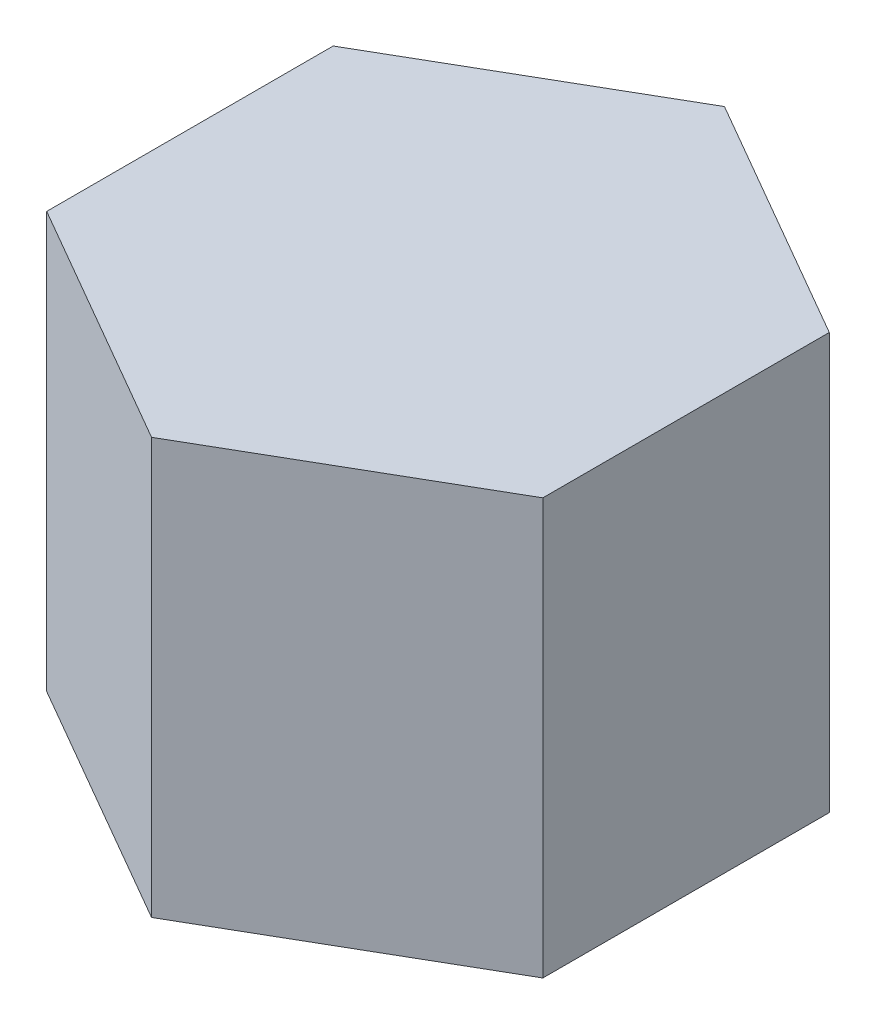
ISO-10303-21;
HEADER;
FILE_DESCRIPTION(('STEP AP214'),'2;1');
FILE_NAME('part.step','',(''),(''),'','','');
FILE_SCHEMA(('AUTOMOTIVE_DESIGN { 1 0 10303 214 1 1 1 1 }'));
ENDSEC;
DATA;
#1=APPLICATION_CONTEXT('core data for automotive mechanical design processes');
#2=APPLICATION_PROTOCOL_DEFINITION('international standard','automotive_design',2000,#1);
#3=PRODUCT_CONTEXT('',#1,'mechanical');
#4=PRODUCT('Part','Part','',(#3));
#5=PRODUCT_RELATED_PRODUCT_CATEGORY('part','',(#4));
#6=PRODUCT_DEFINITION_FORMATION('','',#4);
#7=PRODUCT_DEFINITION_CONTEXT('part definition',#1,'design');
#8=PRODUCT_DEFINITION('design','',#6,#7);
#9=PRODUCT_DEFINITION_SHAPE('','',#8);
#10=(LENGTH_UNIT() NAMED_UNIT(*) SI_UNIT(.MILLI.,.METRE.));
#11=(NAMED_UNIT(*) PLANE_ANGLE_UNIT() SI_UNIT($,.RADIAN.));
#12=(NAMED_UNIT(*) SI_UNIT($,.STERADIAN.) SOLID_ANGLE_UNIT());
#13=UNCERTAINTY_MEASURE_WITH_UNIT(LENGTH_MEASURE(1.E-05),#10,'distance_accuracy_value','');
#14=(GEOMETRIC_REPRESENTATION_CONTEXT(3) GLOBAL_UNCERTAINTY_ASSIGNED_CONTEXT((#13)) GLOBAL_UNIT_ASSIGNED_CONTEXT((#10,
#11,#12)) REPRESENTATION_CONTEXT('',''));
#15=CARTESIAN_POINT('',(0.,0.,0.));
#16=DIRECTION('',(0.,0.,1.));
#17=DIRECTION('',(1.,0.,0.));
#18=AXIS2_PLACEMENT_3D('',#15,#16,#17);
#19=CARTESIAN_POINT('',(204.142660308706,-148.537700895744,288.908895009141));
#20=DIRECTION('',(-0.499999999999943,0.,-0.866025403784472));
#21=DIRECTION('',(-0.866025403784472,0.,0.499999999999943));
#22=AXIS2_PLACEMENT_3D('',#19,#20,#21);
#23=PLANE('',#22);
#24=CARTESIAN_POINT('',(203.839551417382,-149.045793579175,289.083895009141));
#25=DIRECTION('',(0.866025403784471,0.,-0.499999999999943));
#26=VECTOR('',#25,1.);
#27=LINE('',#24,#26);
#28=CARTESIAN_POINT('',(203.839551417382,-149.045793579175,289.083895009141));
#29=VERTEX_POINT('',#28);
#30=CARTESIAN_POINT('',(204.142660308706,-149.045793579175,288.908895009141));
#31=VERTEX_POINT('',#30);
#32=EDGE_CURVE('E170',#29,#31,#27,.T.);
#33=ORIENTED_EDGE('',*,*,#32,.T.);
#34=CARTESIAN_POINT('',(204.142660308706,-148.537700895744,288.908895009141));
#35=DIRECTION('',(0.,-1.,0.));
#36=VECTOR('',#35,1.);
#37=LINE('',#34,#36);
#38=CARTESIAN_POINT('',(204.142660308706,-148.537700895744,288.908895009141));
#39=VERTEX_POINT('',#38);
#40=EDGE_CURVE('E35',#39,#31,#37,.T.);
#41=ORIENTED_EDGE('',*,*,#40,.F.);
#42=CARTESIAN_POINT('',(203.839551417382,-148.537700895744,289.083895009141));
#43=DIRECTION('',(0.866025403784471,0.,-0.499999999999943));
#44=VECTOR('',#43,1.);
#45=LINE('',#42,#44);
#46=CARTESIAN_POINT('',(203.839551417382,-148.537700895744,289.083895009141));
#47=VERTEX_POINT('',#46);
#48=EDGE_CURVE('E159',#47,#39,#45,.T.);
#49=ORIENTED_EDGE('',*,*,#48,.F.);
#50=CARTESIAN_POINT('',(203.839551417382,-148.537700895744,289.083895009141));
#51=DIRECTION('',(0.,-1.,0.));
#52=VECTOR('',#51,1.);
#53=LINE('',#50,#52);
#54=EDGE_CURVE('E10',#47,#29,#53,.T.);
#55=ORIENTED_EDGE('',*,*,#54,.T.);
#56=EDGE_LOOP('',(#33,#41,#49,#55));
#57=FACE_BOUND('',#56,.T.);
#58=ADVANCED_FACE('F16',(#57),#23,.F.);
#59=CARTESIAN_POINT('',(203.839551417382,-148.537700895744,289.083895009141));
#60=DIRECTION('',(0.500000000000062,0.,-0.866025403784403));
#61=DIRECTION('',(-0.866025403784403,0.,-0.500000000000062));
#62=AXIS2_PLACEMENT_3D('',#59,#60,#61);
#63=PLANE('',#62);
#64=CARTESIAN_POINT('',(203.536442526057,-149.045793579175,288.908895009141));
#65=DIRECTION('',(0.866025403784403,0.,0.500000000000062));
#66=VECTOR('',#65,1.);
#67=LINE('',#64,#66);
#68=CARTESIAN_POINT('',(203.536442526057,-149.045793579175,288.908895009141));
#69=VERTEX_POINT('',#68);
#70=EDGE_CURVE('E167',#69,#29,#67,.T.);
#71=ORIENTED_EDGE('',*,*,#70,.T.);
#72=ORIENTED_EDGE('',*,*,#54,.F.);
#73=CARTESIAN_POINT('',(203.536442526057,-148.537700895744,288.908895009141));
#74=DIRECTION('',(0.866025403784403,0.,0.500000000000062));
#75=VECTOR('',#74,1.);
#76=LINE('',#73,#75);
#77=CARTESIAN_POINT('',(203.536442526057,-148.537700895744,288.908895009141));
#78=VERTEX_POINT('',#77);
#79=EDGE_CURVE('E156',#78,#47,#76,.T.);
#80=ORIENTED_EDGE('',*,*,#79,.F.);
#81=CARTESIAN_POINT('',(203.536442526057,-148.537700895744,288.908895009141));
#82=DIRECTION('',(0.,-1.,0.));
#83=VECTOR('',#82,1.);
#84=LINE('',#81,#83);
#85=EDGE_CURVE('E27',#78,#69,#84,.T.);
#86=ORIENTED_EDGE('',*,*,#85,.T.);
#87=EDGE_LOOP('',(#71,#72,#80,#86));
#88=FACE_BOUND('',#87,.T.);
#89=ADVANCED_FACE('F189',(#88),#63,.F.);
#90=CARTESIAN_POINT('',(203.536442526057,-148.537700895744,290.831971220494));
#91=DIRECTION('',(1.,0.,0.));
#92=DIRECTION('',(0.,1.,0.));
#93=AXIS2_PLACEMENT_3D('',#90,#91,#92);
#94=PLANE('',#93);
#95=CARTESIAN_POINT('',(203.536442526057,-149.045793579175,288.558895009141));
#96=DIRECTION('',(0.,0.,1.));
#97=VECTOR('',#96,1.);
#98=LINE('',#95,#97);
#99=CARTESIAN_POINT('',(203.536442526057,-149.045793579175,288.558895009141));
#100=VERTEX_POINT('',#99);
#101=EDGE_CURVE('E163',#100,#69,#98,.T.);
#102=ORIENTED_EDGE('',*,*,#101,.T.);
#103=ORIENTED_EDGE('',*,*,#85,.F.);
#104=CARTESIAN_POINT('',(203.536442526057,-148.537700895744,288.558895009141));
#105=DIRECTION('',(0.,0.,1.));
#106=VECTOR('',#105,1.);
#107=LINE('',#104,#106);
#108=CARTESIAN_POINT('',(203.536442526057,-148.537700895744,288.558895009141));
#109=VERTEX_POINT('',#108);
#110=EDGE_CURVE('E106',#109,#78,#107,.T.);
#111=ORIENTED_EDGE('',*,*,#110,.F.);
#112=CARTESIAN_POINT('',(203.536442526057,-148.537700895744,288.558895009141));
#113=DIRECTION('',(0.,-1.,0.));
#114=VECTOR('',#113,1.);
#115=LINE('',#112,#114);
#116=EDGE_CURVE('E94',#109,#100,#115,.T.);
#117=ORIENTED_EDGE('',*,*,#116,.T.);
#118=EDGE_LOOP('',(#102,#103,#111,#117));
#119=FACE_BOUND('',#118,.T.);
#120=ADVANCED_FACE('F198',(#119),#94,.F.);
#121=CARTESIAN_POINT('',(203.536442526057,-148.537700895744,288.558895009141));
#122=DIRECTION('',(0.499999999999978,0.,0.866025403784452));
#123=DIRECTION('',(0.866025403784452,0.,-0.499999999999978));
#124=AXIS2_PLACEMENT_3D('',#121,#122,#123);
#125=PLANE('',#124);
#126=CARTESIAN_POINT('',(203.839551417382,-149.045793579175,288.383895009141));
#127=DIRECTION('',(-0.866025403784452,0.,0.499999999999978));
#128=VECTOR('',#127,1.);
#129=LINE('',#126,#128);
#130=CARTESIAN_POINT('',(203.839551417382,-149.045793579175,288.383895009141));
#131=VERTEX_POINT('',#130);
#132=EDGE_CURVE('E162',#131,#100,#129,.T.);
#133=ORIENTED_EDGE('',*,*,#132,.T.);
#134=ORIENTED_EDGE('',*,*,#116,.F.);
#135=CARTESIAN_POINT('',(203.839551417382,-148.537700895744,288.383895009141));
#136=DIRECTION('',(-0.866025403784452,0.,0.499999999999978));
#137=VECTOR('',#136,1.);
#138=LINE('',#135,#137);
#139=CARTESIAN_POINT('',(203.839551417382,-148.537700895744,288.383895009141));
#140=VERTEX_POINT('',#139);
#141=EDGE_CURVE('E98',#140,#109,#138,.T.);
#142=ORIENTED_EDGE('',*,*,#141,.F.);
#143=CARTESIAN_POINT('',(203.839551417382,-148.537700895744,288.383895009141));
#144=DIRECTION('',(0.,-1.,0.));
#145=VECTOR('',#144,1.);
#146=LINE('',#143,#145);
#147=EDGE_CURVE('E79',#140,#131,#146,.T.);
#148=ORIENTED_EDGE('',*,*,#147,.T.);
#149=EDGE_LOOP('',(#133,#134,#142,#148));
#150=FACE_BOUND('',#149,.T.);
#151=ADVANCED_FACE('F100',(#150),#125,.F.);
#152=CARTESIAN_POINT('',(203.839551417382,-148.537700895744,288.383895009141));
#153=DIRECTION('',(-0.499999999999978,0.,0.866025403784452));
#154=DIRECTION('',(0.866025403784452,0.,0.499999999999978));
#155=AXIS2_PLACEMENT_3D('',#152,#153,#154);
#156=PLANE('',#155);
#157=CARTESIAN_POINT('',(204.142660308706,-149.045793579175,288.558895009141));
#158=DIRECTION('',(-0.866025403784452,0.,-0.499999999999978));
#159=VECTOR('',#158,1.);
#160=LINE('',#157,#159);
#161=CARTESIAN_POINT('',(204.142660308706,-149.045793579175,288.558895009141));
#162=VERTEX_POINT('',#161);
#163=EDGE_CURVE('E88',#162,#131,#160,.T.);
#164=ORIENTED_EDGE('',*,*,#163,.T.);
#165=ORIENTED_EDGE('',*,*,#147,.F.);
#166=CARTESIAN_POINT('',(204.142660308706,-148.537700895744,288.558895009141));
#167=DIRECTION('',(-0.866025403784452,0.,-0.499999999999978));
#168=VECTOR('',#167,1.);
#169=LINE('',#166,#168);
#170=CARTESIAN_POINT('',(204.142660308706,-148.537700895744,288.558895009141));
#171=VERTEX_POINT('',#170);
#172=EDGE_CURVE('E84',#171,#140,#169,.T.);
#173=ORIENTED_EDGE('',*,*,#172,.F.);
#174=CARTESIAN_POINT('',(204.142660308706,-148.537700895744,288.558895009141));
#175=DIRECTION('',(0.,-1.,0.));
#176=VECTOR('',#175,1.);
#177=LINE('',#174,#176);
#178=EDGE_CURVE('E58',#171,#162,#177,.T.);
#179=ORIENTED_EDGE('',*,*,#178,.T.);
#180=EDGE_LOOP('',(#164,#165,#173,#179));
#181=FACE_BOUND('',#180,.T.);
#182=ADVANCED_FACE('F82',(#181),#156,.F.);
#183=CARTESIAN_POINT('',(204.142660308706,-148.537700895744,290.831971220494));
#184=DIRECTION('',(-1.,0.,0.));
#185=DIRECTION('',(0.,-1.,0.));
#186=AXIS2_PLACEMENT_3D('',#183,#184,#185);
#187=PLANE('',#186);
#188=CARTESIAN_POINT('',(204.142660308706,-149.045793579175,288.908895009141));
#189=DIRECTION('',(0.,0.,-1.));
#190=VECTOR('',#189,1.);
#191=LINE('',#188,#190);
#192=EDGE_CURVE('E160',#31,#162,#191,.T.);
#193=ORIENTED_EDGE('',*,*,#192,.T.);
#194=ORIENTED_EDGE('',*,*,#178,.F.);
#195=CARTESIAN_POINT('',(204.142660308706,-148.537700895744,288.908895009141));
#196=DIRECTION('',(0.,0.,-1.));
#197=VECTOR('',#196,1.);
#198=LINE('',#195,#197);
#199=EDGE_CURVE('E112',#39,#171,#198,.T.);
#200=ORIENTED_EDGE('',*,*,#199,.F.);
#201=ORIENTED_EDGE('',*,*,#40,.T.);
#202=EDGE_LOOP('',(#193,#194,#200,#201));
#203=FACE_BOUND('',#202,.T.);
#204=ADVANCED_FACE('F131',(#203),#187,.F.);
#205=CARTESIAN_POINT('',(206.339551417382,-148.537700895744,290.831971220494));
#206=DIRECTION('',(0.,-1.,0.));
#207=DIRECTION('',(1.,0.,0.));
#208=AXIS2_PLACEMENT_3D('',#205,#206,#207);
#209=PLANE('',#208);
#210=ORIENTED_EDGE('',*,*,#48,.T.);
#211=ORIENTED_EDGE('',*,*,#199,.T.);
#212=ORIENTED_EDGE('',*,*,#172,.T.);
#213=ORIENTED_EDGE('',*,*,#141,.T.);
#214=ORIENTED_EDGE('',*,*,#110,.T.);
#215=ORIENTED_EDGE('',*,*,#79,.T.);
#216=EDGE_LOOP('',(#210,#211,#212,#213,#214,#215));
#217=FACE_BOUND('',#216,.T.);
#218=ADVANCED_FACE('F111',(#217),#209,.F.);
#219=CARTESIAN_POINT('',(206.339551417382,-149.045793579175,290.831971220494));
#220=DIRECTION('',(0.,-1.,0.));
#221=DIRECTION('',(1.,0.,0.));
#222=AXIS2_PLACEMENT_3D('',#219,#220,#221);
#223=PLANE('',#222);
#224=ORIENTED_EDGE('',*,*,#32,.F.);
#225=ORIENTED_EDGE('',*,*,#70,.F.);
#226=ORIENTED_EDGE('',*,*,#101,.F.);
#227=ORIENTED_EDGE('',*,*,#132,.F.);
#228=ORIENTED_EDGE('',*,*,#163,.F.);
#229=ORIENTED_EDGE('',*,*,#192,.F.);
#230=EDGE_LOOP('',(#224,#225,#226,#227,#228,#229));
#231=FACE_BOUND('',#230,.T.);
#232=ADVANCED_FACE('F130',(#231),#223,.T.);
#233=CLOSED_SHELL('',(#58,#89,#120,#151,#182,#204,#218,#232));
#234=MANIFOLD_SOLID_BREP('B1',#233);
#235=ADVANCED_BREP_SHAPE_REPRESENTATION('',(#18,#234),#14);
#236=SHAPE_DEFINITION_REPRESENTATION(#9,#235);
ENDSEC;
END-ISO-10303-21;
